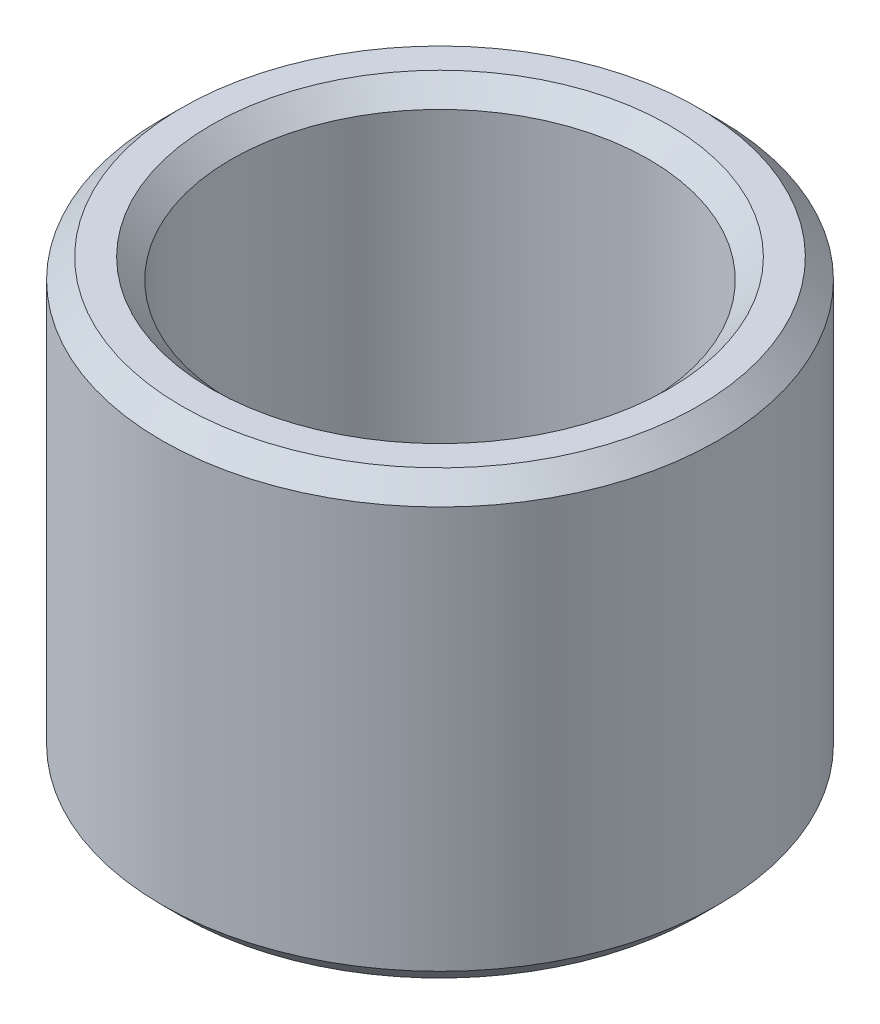
ISO-10303-21;
HEADER;
FILE_DESCRIPTION(('STEP AP214'),'2;1');
FILE_NAME('part.step','',(''),(''),'','','');
FILE_SCHEMA(('AUTOMOTIVE_DESIGN { 1 0 10303 214 1 1 1 1 }'));
ENDSEC;
DATA;
#1=APPLICATION_CONTEXT('core data for automotive mechanical design processes');
#2=APPLICATION_PROTOCOL_DEFINITION('international standard','automotive_design',2000,#1);
#3=PRODUCT_CONTEXT('',#1,'mechanical');
#4=PRODUCT('Part','Part','',(#3));
#5=PRODUCT_RELATED_PRODUCT_CATEGORY('part','',(#4));
#6=PRODUCT_DEFINITION_FORMATION('','',#4);
#7=PRODUCT_DEFINITION_CONTEXT('part definition',#1,'design');
#8=PRODUCT_DEFINITION('design','',#6,#7);
#9=PRODUCT_DEFINITION_SHAPE('','',#8);
#10=(LENGTH_UNIT() NAMED_UNIT(*) SI_UNIT(.MILLI.,.METRE.));
#11=(NAMED_UNIT(*) PLANE_ANGLE_UNIT() SI_UNIT($,.RADIAN.));
#12=(NAMED_UNIT(*) SI_UNIT($,.STERADIAN.) SOLID_ANGLE_UNIT());
#13=UNCERTAINTY_MEASURE_WITH_UNIT(LENGTH_MEASURE(1.E-05),#10,'distance_accuracy_value','');
#14=(GEOMETRIC_REPRESENTATION_CONTEXT(3) GLOBAL_UNCERTAINTY_ASSIGNED_CONTEXT((#13)) GLOBAL_UNIT_ASSIGNED_CONTEXT((#10,
#11,#12)) REPRESENTATION_CONTEXT('',''));
#15=CARTESIAN_POINT('',(0.,0.,0.));
#16=DIRECTION('',(0.,0.,1.));
#17=DIRECTION('',(1.,0.,0.));
#18=AXIS2_PLACEMENT_3D('',#15,#16,#17);
#19=CARTESIAN_POINT('',(0.,23.8221574408183,0.));
#20=DIRECTION('',(0.,-1.,0.));
#21=DIRECTION('',(0.,0.,-1.));
#22=AXIS2_PLACEMENT_3D('',#19,#20,#21);
#23=CYLINDRICAL_SURFACE('',#22,15.);
#24=CARTESIAN_POINT('',(0.,1.07134707416921,0.));
#25=DIRECTION('',(0.,1.,0.));
#26=DIRECTION('',(0.,0.,1.));
#27=AXIS2_PLACEMENT_3D('',#24,#25,#26);
#28=CIRCLE('',#27,15.);
#29=CARTESIAN_POINT('',(0.,1.07134707416921,15.));
#30=VERTEX_POINT('',#29);
#31=EDGE_CURVE('E10',#30,#30,#28,.T.);
#32=ORIENTED_EDGE('',*,*,#31,.T.);
#33=EDGE_LOOP('',(#32));
#34=FACE_BOUND('',#33,.T.);
#35=CARTESIAN_POINT('',(0.,22.7508103666491,0.));
#36=DIRECTION('',(0.,1.,0.));
#37=DIRECTION('',(0.,0.,1.));
#38=AXIS2_PLACEMENT_3D('',#35,#36,#37);
#39=CIRCLE('',#38,15.);
#40=CARTESIAN_POINT('',(0.,22.7508103666491,15.));
#41=VERTEX_POINT('',#40);
#42=EDGE_CURVE('E50',#41,#41,#39,.F.);
#43=ORIENTED_EDGE('',*,*,#42,.T.);
#44=EDGE_LOOP('',(#43));
#45=FACE_BOUND('',#44,.T.);
#46=ADVANCED_FACE('F39',(#34,#45),#23,.T.);
#47=CARTESIAN_POINT('',(0.,23.8221574408183,0.));
#48=DIRECTION('',(0.,1.,0.));
#49=DIRECTION('',(0.,0.,1.));
#50=AXIS2_PLACEMENT_3D('',#47,#48,#49);
#51=PLANE('',#50);
#52=CARTESIAN_POINT('',(0.,23.8221574408183,0.));
#53=DIRECTION('',(0.,1.,0.));
#54=DIRECTION('',(0.,0.,1.));
#55=AXIS2_PLACEMENT_3D('',#52,#53,#54);
#56=CIRCLE('',#55,12.3292957145646);
#57=CARTESIAN_POINT('',(0.,23.8221574408183,12.3292957145646));
#58=VERTEX_POINT('',#57);
#59=EDGE_CURVE('E58',#58,#58,#56,.F.);
#60=ORIENTED_EDGE('',*,*,#59,.T.);
#61=EDGE_LOOP('',(#60));
#62=FACE_BOUND('',#61,.T.);
#63=CARTESIAN_POINT('',(0.,23.8221574408183,0.));
#64=DIRECTION('',(0.,1.,0.));
#65=DIRECTION('',(0.,0.,1.));
#66=AXIS2_PLACEMENT_3D('',#63,#64,#65);
#67=CIRCLE('',#66,13.9286529258308);
#68=CARTESIAN_POINT('',(0.,23.8221574408183,13.9286529258308));
#69=VERTEX_POINT('',#68);
#70=EDGE_CURVE('E61',#69,#69,#67,.T.);
#71=ORIENTED_EDGE('',*,*,#70,.T.);
#72=EDGE_LOOP('',(#71));
#73=FACE_BOUND('',#72,.T.);
#74=ADVANCED_FACE('F88',(#62,#73),#51,.T.);
#75=CARTESIAN_POINT('',(0.,0.,0.));
#76=DIRECTION('',(0.,1.,0.));
#77=DIRECTION('',(0.,0.,1.));
#78=AXIS2_PLACEMENT_3D('',#75,#76,#77);
#79=PLANE('',#78);
#80=CARTESIAN_POINT('',(0.,0.,0.));
#81=DIRECTION('',(0.,1.,0.));
#82=DIRECTION('',(0.,0.,1.));
#83=AXIS2_PLACEMENT_3D('',#80,#81,#82);
#84=CIRCLE('',#83,12.3292957145646);
#85=CARTESIAN_POINT('',(0.,0.,12.3292957145646));
#86=VERTEX_POINT('',#85);
#87=EDGE_CURVE('E51',#86,#86,#84,.T.);
#88=ORIENTED_EDGE('',*,*,#87,.T.);
#89=EDGE_LOOP('',(#88));
#90=FACE_BOUND('',#89,.T.);
#91=CARTESIAN_POINT('',(0.,0.,0.));
#92=DIRECTION('',(0.,1.,0.));
#93=DIRECTION('',(0.,0.,1.));
#94=AXIS2_PLACEMENT_3D('',#91,#92,#93);
#95=CIRCLE('',#94,13.9286529258308);
#96=CARTESIAN_POINT('',(0.,0.,13.9286529258308));
#97=VERTEX_POINT('',#96);
#98=EDGE_CURVE('E54',#97,#97,#95,.F.);
#99=ORIENTED_EDGE('',*,*,#98,.T.);
#100=EDGE_LOOP('',(#99));
#101=FACE_BOUND('',#100,.T.);
#102=ADVANCED_FACE('F83',(#90,#101),#79,.F.);
#103=CARTESIAN_POINT('',(0.,23.8221574408183,0.));
#104=DIRECTION('',(0.,-1.,0.));
#105=DIRECTION('',(0.,0.,-1.));
#106=AXIS2_PLACEMENT_3D('',#103,#104,#105);
#107=CYLINDRICAL_SURFACE('',#106,11.2579486403954);
#108=CARTESIAN_POINT('',(0.,22.7508103666491,0.));
#109=DIRECTION('',(0.,1.,0.));
#110=DIRECTION('',(0.,0.,1.));
#111=AXIS2_PLACEMENT_3D('',#108,#109,#110);
#112=CIRCLE('',#111,11.2579486403954);
#113=CARTESIAN_POINT('',(0.,22.7508103666491,11.2579486403954));
#114=VERTEX_POINT('',#113);
#115=EDGE_CURVE('E67',#114,#114,#112,.T.);
#116=ORIENTED_EDGE('',*,*,#115,.T.);
#117=EDGE_LOOP('',(#116));
#118=FACE_BOUND('',#117,.T.);
#119=CARTESIAN_POINT('',(0.,1.07134707416922,0.));
#120=DIRECTION('',(0.,1.,0.));
#121=DIRECTION('',(0.,0.,1.));
#122=AXIS2_PLACEMENT_3D('',#119,#120,#121);
#123=CIRCLE('',#122,11.2579486403954);
#124=CARTESIAN_POINT('',(0.,1.07134707416922,11.2579486403954));
#125=VERTEX_POINT('',#124);
#126=EDGE_CURVE('E69',#125,#125,#123,.F.);
#127=ORIENTED_EDGE('',*,*,#126,.T.);
#128=EDGE_LOOP('',(#127));
#129=FACE_BOUND('',#128,.T.);
#130=ADVANCED_FACE('F71',(#118,#129),#107,.F.);
#131=CARTESIAN_POINT('',(0.,22.7508103666491,0.));
#132=DIRECTION('',(0.,1.,0.));
#133=DIRECTION('',(0.,0.,1.));
#134=AXIS2_PLACEMENT_3D('',#131,#132,#133);
#135=CONICAL_SURFACE('',#134,11.2579486403954,0.785398163397453);
#136=ORIENTED_EDGE('',*,*,#59,.F.);
#137=EDGE_LOOP('',(#136));
#138=FACE_BOUND('',#137,.T.);
#139=ORIENTED_EDGE('',*,*,#115,.F.);
#140=EDGE_LOOP('',(#139));
#141=FACE_BOUND('',#140,.T.);
#142=ADVANCED_FACE('F77',(#138,#141),#135,.F.);
#143=CARTESIAN_POINT('',(0.,0.,0.));
#144=DIRECTION('',(0.,-1.,0.));
#145=DIRECTION('',(0.,0.,-1.));
#146=AXIS2_PLACEMENT_3D('',#143,#144,#145);
#147=CONICAL_SURFACE('',#146,12.3292957145646,0.785398163397444);
#148=ORIENTED_EDGE('',*,*,#126,.F.);
#149=EDGE_LOOP('',(#148));
#150=FACE_BOUND('',#149,.T.);
#151=ORIENTED_EDGE('',*,*,#87,.F.);
#152=EDGE_LOOP('',(#151));
#153=FACE_BOUND('',#152,.T.);
#154=ADVANCED_FACE('F73',(#150,#153),#147,.F.);
#155=CARTESIAN_POINT('',(0.,1.07134707416921,0.));
#156=DIRECTION('',(0.,1.,0.));
#157=DIRECTION('',(0.,0.,1.));
#158=AXIS2_PLACEMENT_3D('',#155,#156,#157);
#159=CONICAL_SURFACE('',#158,15.,0.785398163397453);
#160=ORIENTED_EDGE('',*,*,#98,.F.);
#161=EDGE_LOOP('',(#160));
#162=FACE_BOUND('',#161,.T.);
#163=ORIENTED_EDGE('',*,*,#31,.F.);
#164=EDGE_LOOP('',(#163));
#165=FACE_BOUND('',#164,.T.);
#166=ADVANCED_FACE('F76',(#162,#165),#159,.T.);
#167=CARTESIAN_POINT('',(0.,23.8221574408183,0.));
#168=DIRECTION('',(0.,-1.,0.));
#169=DIRECTION('',(0.,0.,-1.));
#170=AXIS2_PLACEMENT_3D('',#167,#168,#169);
#171=CONICAL_SURFACE('',#170,13.9286529258308,0.785398163397445);
#172=ORIENTED_EDGE('',*,*,#42,.F.);
#173=EDGE_LOOP('',(#172));
#174=FACE_BOUND('',#173,.T.);
#175=ORIENTED_EDGE('',*,*,#70,.F.);
#176=EDGE_LOOP('',(#175));
#177=FACE_BOUND('',#176,.T.);
#178=ADVANCED_FACE('F45',(#174,#177),#171,.T.);
#179=CLOSED_SHELL('',(#46,#74,#102,#130,#142,#154,#166,#178));
#180=MANIFOLD_SOLID_BREP('B2',#179);
#181=ADVANCED_BREP_SHAPE_REPRESENTATION('',(#18,#180),#14);
#182=SHAPE_DEFINITION_REPRESENTATION(#9,#181);
ENDSEC;
END-ISO-10303-21;
